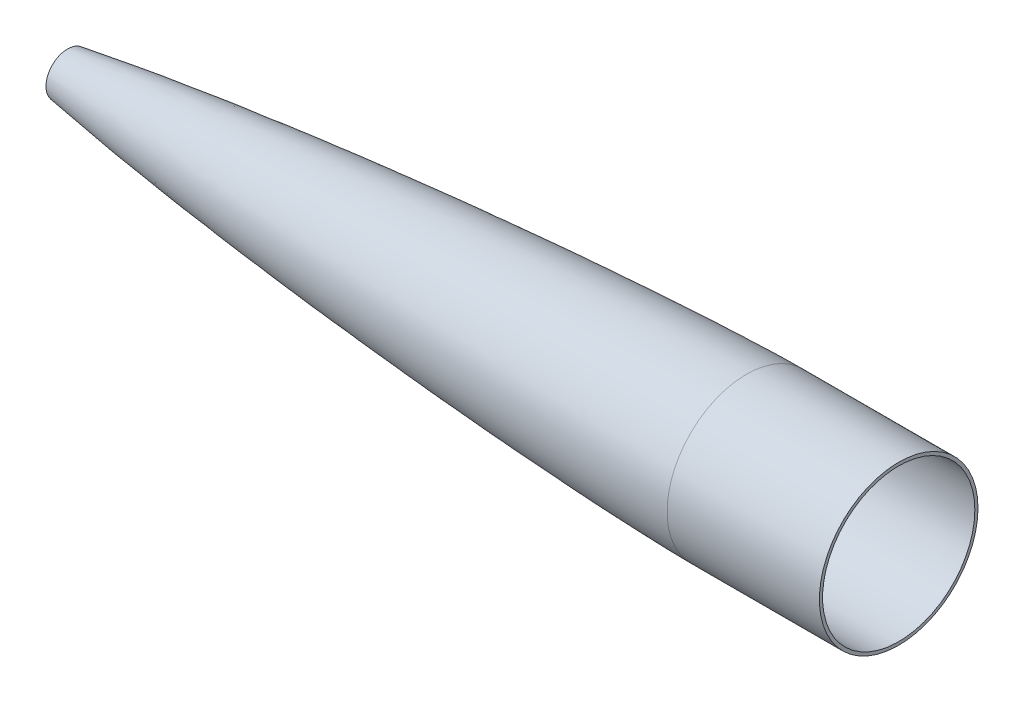
ISO-10303-21;
HEADER;
FILE_DESCRIPTION(('STEP AP214'),'2;1');
FILE_NAME('part.step','',(''),(''),'','','');
FILE_SCHEMA(('AUTOMOTIVE_DESIGN { 1 0 10303 214 1 1 1 1 }'));
ENDSEC;
DATA;
#1=APPLICATION_CONTEXT('core data for automotive mechanical design processes');
#2=APPLICATION_PROTOCOL_DEFINITION('international standard','automotive_design',2000,#1);
#3=PRODUCT_CONTEXT('',#1,'mechanical');
#4=PRODUCT('Part','Part','',(#3));
#5=PRODUCT_RELATED_PRODUCT_CATEGORY('part','',(#4));
#6=PRODUCT_DEFINITION_FORMATION('','',#4);
#7=PRODUCT_DEFINITION_CONTEXT('part definition',#1,'design');
#8=PRODUCT_DEFINITION('design','',#6,#7);
#9=PRODUCT_DEFINITION_SHAPE('','',#8);
#10=(LENGTH_UNIT() NAMED_UNIT(*) SI_UNIT(.MILLI.,.METRE.));
#11=(NAMED_UNIT(*) PLANE_ANGLE_UNIT() SI_UNIT($,.RADIAN.));
#12=(NAMED_UNIT(*) SI_UNIT($,.STERADIAN.) SOLID_ANGLE_UNIT());
#13=UNCERTAINTY_MEASURE_WITH_UNIT(LENGTH_MEASURE(1.E-05),#10,'distance_accuracy_value','');
#14=(GEOMETRIC_REPRESENTATION_CONTEXT(3) GLOBAL_UNCERTAINTY_ASSIGNED_CONTEXT((#13)) GLOBAL_UNIT_ASSIGNED_CONTEXT((#10,
#11,#12)) REPRESENTATION_CONTEXT('',''));
#15=CARTESIAN_POINT('',(0.,0.,0.));
#16=DIRECTION('',(0.,0.,1.));
#17=DIRECTION('',(1.,0.,0.));
#18=AXIS2_PLACEMENT_3D('',#15,#16,#17);
#19=CARTESIAN_POINT('',(82.5499999999162,18.4343756299869,0.));
#20=CARTESIAN_POINT('',(83.7393177107767,18.6289190163164,0.));
#21=CARTESIAN_POINT('',(86.1131241046611,19.0145665661421,0.));
#22=CARTESIAN_POINT('',(90.7443920769839,19.7604836600196,0.));
#23=CARTESIAN_POINT('',(95.4345019493726,20.497768813238,0.));
#24=CARTESIAN_POINT('',(100.978713129585,21.3612401102837,0.));
#25=CARTESIAN_POINT('',(106.058901751683,22.1360376612387,0.));
#26=CARTESIAN_POINT('',(112.686881735105,23.1348451629217,0.));
#27=CARTESIAN_POINT('',(121.588127674716,24.4481959763901,0.));
#28=CARTESIAN_POINT('',(132.960891433023,26.0828324549279,0.));
#29=CARTESIAN_POINT('',(148.228562585128,28.2049004015301,0.));
#30=CARTESIAN_POINT('',(163.541095633571,30.2533424201653,0.));
#31=CARTESIAN_POINT('',(177.757213331542,32.0933543438745,0.));
#32=CARTESIAN_POINT('',(193.536259625857,34.0794991665762,0.));
#33=CARTESIAN_POINT('',(209.315792622343,36.0117913138049,0.));
#34=CARTESIAN_POINT('',(227.738082588185,38.1950479539982,0.));
#35=CARTESIAN_POINT('',(248.800039239039,40.5989713983124,0.));
#36=CARTESIAN_POINT('',(269.872934088202,42.9183956265019,0.));
#37=CARTESIAN_POINT('',(290.953613446356,45.1578106960572,0.));
#38=CARTESIAN_POINT('',(312.042727731175,47.3213543798574,0.));
#39=CARTESIAN_POINT('',(333.138872622564,49.4120506524534,0.));
#40=CARTESIAN_POINT('',(354.242048188851,51.4324923306986,0.));
#41=CARTESIAN_POINT('',(375.351537944768,53.3846172544587,0.));
#42=CARTESIAN_POINT('',(396.467163528346,55.2699410364207,0.));
#43=CARTESIAN_POINT('',(417.588515841752,57.089547842827,0.));
#44=CARTESIAN_POINT('',(443.997107776858,59.2827252928493,0.));
#45=CARTESIAN_POINT('',(475.697958941645,61.7850890861878,0.));
#46=CARTESIAN_POINT('',(512.696839970235,64.5152829874717,0.));
#47=CARTESIAN_POINT('',(555.000098175053,67.3693531316125,0.));
#48=CARTESIAN_POINT('',(597.321403854525,69.9425410139262,0.));
#49=CARTESIAN_POINT('',(639.6602687201,72.2102193306455,0.));
#50=CARTESIAN_POINT('',(678.435776142463,73.9669541643537,0.));
#51=CARTESIAN_POINT('',(711.723143924299,75.1789564985475,0.));
#52=CARTESIAN_POINT('',(735.72093001852,75.8220485517601,0.));
#53=CARTESIAN_POINT('',(749.773416046705,76.0837400946624,0.));
#54=CARTESIAN_POINT('',(757.460733051443,76.1731692150984,0.));
#55=CARTESIAN_POINT('',(760.054576070804,76.1931721333903,0.));
#56=CARTESIAN_POINT('',(761.351521386119,76.1985956636683,0.));
#57=CARTESIAN_POINT('',(762.,76.2,0.));
#58=B_SPLINE_CURVE_WITH_KNOTS('',4,(#19,#20,#21,#22,#23,#24,#25,#26,#27,#28,#29,#30,#31,#32,#33,
#34,#35,#36,#37,#38,#39,#40,#41,#42,#43,#44,#45,#46,#47,#48,#49,#50,#51,#52,#53,#54,#55,#56,
#57),.UNSPECIFIED.,.F.,.F.,(5,1,1,1,1,1,1,1,1,1,1,1,1,1,1,1,1,1,1,1,1,1,1,1,1,1,1,1,1,1,1,1,1,1,
1,5),(0.0904541163257518,0.0975187570717689,0.104583397817786,0.111648038563803,
0.11871267930982,0.125777317838623,0.132841956367426,0.146971233425032,0.166926198929399,
0.186881164433766,0.215139720260895,0.229268998174459,0.243398276088024,0.271656830632247,
0.29991538517647,0.328173940546818,0.356432495917167,0.384691050395995,0.412949604874823,
0.441208160481712,0.469466716088601,0.497725271116411,0.525983826144221,0.554242380934212,
0.582500935724203,0.639018046516864,0.695535156926564,0.752052267016401,0.808569376936375,
0.865086487093434,0.921603597621044,0.959009278705022,0.986169476429817,0.993084738214908,
0.996542369107454,1.),.UNSPECIFIED.);
#59=CARTESIAN_POINT('',(993.469790119827,0.,0.));
#60=DIRECTION('',(1.,0.,0.));
#61=AXIS1_PLACEMENT('',#59,#60);
#62=SURFACE_OF_REVOLUTION('',#58,#61);
#63=CARTESIAN_POINT('',(762.,0.,0.));
#64=DIRECTION('',(1.,0.,0.));
#65=DIRECTION('',(0.,0.,-1.));
#66=AXIS2_PLACEMENT_3D('',#63,#64,#65);
#67=CIRCLE('',#66,76.2);
#68=CARTESIAN_POINT('',(762.,0.,-76.2));
#69=VERTEX_POINT('',#68);
#70=EDGE_CURVE('E10',#69,#69,#67,.T.);
#71=ORIENTED_EDGE('',*,*,#70,.T.);
#72=EDGE_LOOP('',(#71));
#73=FACE_BOUND('',#72,.T.);
#74=CARTESIAN_POINT('',(82.5499999999168,0.,0.));
#75=DIRECTION('',(1.,0.,0.));
#76=DIRECTION('',(0.,0.,-1.));
#77=AXIS2_PLACEMENT_3D('',#74,#75,#76);
#78=CIRCLE('',#77,18.434375629987);
#79=CARTESIAN_POINT('',(82.5499999999168,0.,-18.434375629987));
#80=VERTEX_POINT('',#79);
#81=EDGE_CURVE('E71',#80,#80,#78,.T.);
#82=ORIENTED_EDGE('',*,*,#81,.F.);
#83=EDGE_LOOP('',(#82));
#84=FACE_BOUND('',#83,.T.);
#85=ADVANCED_FACE('F43',(#73,#84),#62,.F.);
#86=CARTESIAN_POINT('',(993.469790119827,0.,0.));
#87=DIRECTION('',(1.,0.,0.));
#88=DIRECTION('',(0.,0.,-1.));
#89=AXIS2_PLACEMENT_3D('',#86,#87,#88);
#90=CYLINDRICAL_SURFACE('',#89,76.2);
#91=CARTESIAN_POINT('',(914.4,0.,0.));
#92=DIRECTION('',(1.,0.,0.));
#93=DIRECTION('',(0.,0.,-1.));
#94=AXIS2_PLACEMENT_3D('',#91,#92,#93);
#95=CIRCLE('',#94,76.2);
#96=CARTESIAN_POINT('',(914.4,0.,-76.2));
#97=VERTEX_POINT('',#96);
#98=EDGE_CURVE('E51',#97,#97,#95,.T.);
#99=ORIENTED_EDGE('',*,*,#98,.T.);
#100=EDGE_LOOP('',(#99));
#101=FACE_BOUND('',#100,.T.);
#102=ORIENTED_EDGE('',*,*,#70,.F.);
#103=EDGE_LOOP('',(#102));
#104=FACE_BOUND('',#103,.T.);
#105=ADVANCED_FACE('F97',(#101,#104),#90,.F.);
#106=CARTESIAN_POINT('',(914.4,76.2,0.));
#107=DIRECTION('',(1.,0.,0.));
#108=DIRECTION('',(0.,0.,-1.));
#109=AXIS2_PLACEMENT_3D('',#106,#107,#108);
#110=PLANE('',#109);
#111=CARTESIAN_POINT('',(914.4,0.,0.));
#112=DIRECTION('',(1.,0.,0.));
#113=DIRECTION('',(0.,0.,-1.));
#114=AXIS2_PLACEMENT_3D('',#111,#112,#113);
#115=CIRCLE('',#114,79.375);
#116=CARTESIAN_POINT('',(914.4,0.,-79.375));
#117=VERTEX_POINT('',#116);
#118=EDGE_CURVE('E56',#117,#117,#115,.T.);
#119=ORIENTED_EDGE('',*,*,#118,.T.);
#120=EDGE_LOOP('',(#119));
#121=FACE_BOUND('',#120,.T.);
#122=ORIENTED_EDGE('',*,*,#98,.F.);
#123=EDGE_LOOP('',(#122));
#124=FACE_BOUND('',#123,.T.);
#125=ADVANCED_FACE('F94',(#121,#124),#110,.T.);
#126=CARTESIAN_POINT('',(993.469790119827,0.,0.));
#127=DIRECTION('',(1.,0.,0.));
#128=DIRECTION('',(0.,0.,-1.));
#129=AXIS2_PLACEMENT_3D('',#126,#127,#128);
#130=CYLINDRICAL_SURFACE('',#129,79.375);
#131=CARTESIAN_POINT('',(762.000000000001,0.,0.));
#132=DIRECTION('',(1.,0.,0.));
#133=DIRECTION('',(0.,0.,-1.));
#134=AXIS2_PLACEMENT_3D('',#131,#132,#133);
#135=CIRCLE('',#134,79.3750000000001);
#136=CARTESIAN_POINT('',(762.000000000001,0.,-79.3750000000001));
#137=VERTEX_POINT('',#136);
#138=EDGE_CURVE('E61',#137,#137,#135,.T.);
#139=ORIENTED_EDGE('',*,*,#138,.T.);
#140=EDGE_LOOP('',(#139));
#141=FACE_BOUND('',#140,.T.);
#142=ORIENTED_EDGE('',*,*,#118,.F.);
#143=EDGE_LOOP('',(#142));
#144=FACE_BOUND('',#143,.T.);
#145=ADVANCED_FACE('F90',(#141,#144),#130,.T.);
#146=CARTESIAN_POINT('',(762.000000000001,79.3750000000001,0.));
#147=CARTESIAN_POINT('',(761.35152138612,79.3735956636681,0.));
#148=CARTESIAN_POINT('',(760.054576070805,79.3681721333897,0.));
#149=CARTESIAN_POINT('',(757.460733051445,79.3481692150967,0.));
#150=CARTESIAN_POINT('',(749.773416046706,79.2587400946577,0.));
#151=CARTESIAN_POINT('',(735.720930018521,78.99704855175,0.));
#152=CARTESIAN_POINT('',(711.7231439243,78.3539564985281,0.));
#153=CARTESIAN_POINT('',(678.435776142465,77.1419541643214,0.));
#154=CARTESIAN_POINT('',(639.660268720102,75.3852193305981,0.));
#155=CARTESIAN_POINT('',(597.321403854529,73.1175410138624,0.));
#156=CARTESIAN_POINT('',(555.000098175058,70.5443531315324,0.));
#157=CARTESIAN_POINT('',(512.69683997024,67.6902829873751,0.));
#158=CARTESIAN_POINT('',(475.697958941652,64.9600890860768,0.));
#159=CARTESIAN_POINT('',(443.997107776866,62.4577252927261,0.));
#160=CARTESIAN_POINT('',(417.58851584176,60.2645478426935,0.));
#161=CARTESIAN_POINT('',(396.467163528355,58.444941036279,0.));
#162=CARTESIAN_POINT('',(375.351537944778,56.5596172543088,0.));
#163=CARTESIAN_POINT('',(354.242048188861,54.6074923305406,0.));
#164=CARTESIAN_POINT('',(333.138872622575,52.5870506522872,0.));
#165=CARTESIAN_POINT('',(312.042727731187,50.496354379683,0.));
#166=CARTESIAN_POINT('',(290.953613446369,48.3328106958746,0.));
#167=CARTESIAN_POINT('',(269.872934088216,46.0933956263111,0.));
#168=CARTESIAN_POINT('',(248.800039239054,43.7739713981135,0.));
#169=CARTESIAN_POINT('',(227.7380825882,41.3700479537911,0.));
#170=CARTESIAN_POINT('',(209.31579262236,39.1867913135906,0.));
#171=CARTESIAN_POINT('',(193.536259625874,37.2544991663558,0.));
#172=CARTESIAN_POINT('',(177.75721333156,35.268354343648,0.));
#173=CARTESIAN_POINT('',(163.54109563359,33.4283424199333,0.));
#174=CARTESIAN_POINT('',(148.228562585148,31.3799004012921,0.));
#175=CARTESIAN_POINT('',(132.960891433044,29.2578324546841,0.));
#176=CARTESIAN_POINT('',(121.588127674737,27.6231959761418,0.));
#177=CARTESIAN_POINT('',(112.686881735127,26.30984516267,0.));
#178=CARTESIAN_POINT('',(106.058901751705,25.3110376609844,0.));
#179=CARTESIAN_POINT('',(100.978713129608,24.5362401100274,0.));
#180=CARTESIAN_POINT('',(95.4345019493953,23.6727688129796,0.));
#181=CARTESIAN_POINT('',(90.744392077001,22.9354836597584,0.));
#182=CARTESIAN_POINT('',(86.1131241046688,22.1895665658775,0.));
#183=CARTESIAN_POINT('',(83.7393177107822,21.8039190160505,0.));
#184=CARTESIAN_POINT('',(82.5499999999158,21.6093756297196,0.));
#185=B_SPLINE_CURVE_WITH_KNOTS('',4,(#146,#147,#148,#149,#150,#151,#152,#153,#154,#155,#156,
#157,#158,#159,#160,#161,#162,#163,#164,#165,#166,#167,#168,#169,#170,#171,#172,#173,#174,#175,
#176,#177,#178,#179,#180,#181,#182,#183,#184),.UNSPECIFIED.,.F.,.F.,(5,1,1,1,1,1,1,1,1,1,1,1,1,
1,1,1,1,1,1,1,1,1,1,1,1,1,1,1,1,1,1,1,1,1,1,5),(0.0904541163257518,0.0939117472182976,
0.0973693781108436,0.104284639895935,0.13144483762073,0.168850518704708,0.225367629232318,
0.281884739389377,0.338401849309351,0.394918959399188,0.451436069808888,0.507953180601549,
0.53621173539154,0.564470290181531,0.592728845209341,0.62098740023715,0.64924595584404,
0.677504511450929,0.705763065929757,0.734021620408585,0.762280175778933,0.790538731149282,
0.818797285693505,0.847055840237728,0.861185118151293,0.875314396064857,0.903572951891986,
0.923527917396353,0.94348288290072,0.957612159958326,0.964676798487129,0.971741437015932,
0.978806077761949,0.985870718507966,0.992935359253983,1.),.UNSPECIFIED.);
#186=CARTESIAN_POINT('',(993.469790119827,0.,0.));
#187=DIRECTION('',(1.,0.,0.));
#188=AXIS1_PLACEMENT('',#186,#187);
#189=SURFACE_OF_REVOLUTION('',#185,#188);
#190=CARTESIAN_POINT('',(82.5499999999162,0.,0.));
#191=DIRECTION('',(1.,0.,0.));
#192=DIRECTION('',(0.,0.,-1.));
#193=AXIS2_PLACEMENT_3D('',#190,#191,#192);
#194=CIRCLE('',#193,21.609375629721);
#195=CARTESIAN_POINT('',(82.5499999999162,0.,-21.609375629721));
#196=VERTEX_POINT('',#195);
#197=EDGE_CURVE('E67',#196,#196,#194,.T.);
#198=ORIENTED_EDGE('',*,*,#197,.T.);
#199=EDGE_LOOP('',(#198));
#200=FACE_BOUND('',#199,.T.);
#201=ORIENTED_EDGE('',*,*,#138,.F.);
#202=EDGE_LOOP('',(#201));
#203=FACE_BOUND('',#202,.T.);
#204=ADVANCED_FACE('F85',(#200,#203),#189,.F.);
#205=CARTESIAN_POINT('',(82.5499999999165,21.609375629721,0.));
#206=DIRECTION('',(-1.,0.,0.));
#207=DIRECTION('',(0.,0.,1.));
#208=AXIS2_PLACEMENT_3D('',#205,#206,#207);
#209=PLANE('',#208);
#210=ORIENTED_EDGE('',*,*,#81,.T.);
#211=EDGE_LOOP('',(#210));
#212=FACE_BOUND('',#211,.T.);
#213=ORIENTED_EDGE('',*,*,#197,.F.);
#214=EDGE_LOOP('',(#213));
#215=FACE_BOUND('',#214,.T.);
#216=ADVANCED_FACE('F89',(#212,#215),#209,.T.);
#217=CLOSED_SHELL('',(#85,#105,#125,#145,#204,#216));
#218=MANIFOLD_SOLID_BREP('B2',#217);
#219=ADVANCED_BREP_SHAPE_REPRESENTATION('',(#18,#218),#14);
#220=SHAPE_DEFINITION_REPRESENTATION(#9,#219);
ENDSEC;
END-ISO-10303-21;
